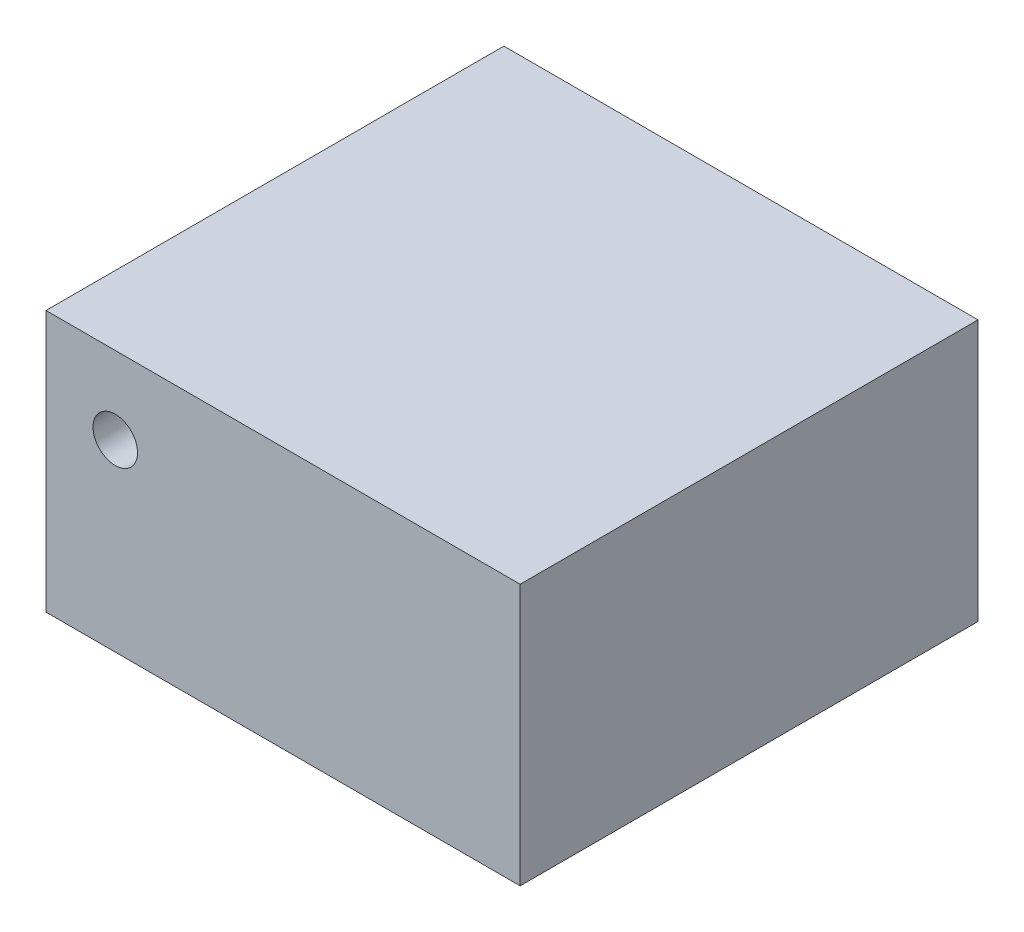
ISO-10303-21;
HEADER;
FILE_DESCRIPTION(('STEP AP214'),'2;1');
FILE_NAME('part.step','',(''),(''),'','','');
FILE_SCHEMA(('AUTOMOTIVE_DESIGN { 1 0 10303 214 1 1 1 1 }'));
ENDSEC;
DATA;
#1=APPLICATION_CONTEXT('core data for automotive mechanical design processes');
#2=APPLICATION_PROTOCOL_DEFINITION('international standard','automotive_design',2000,#1);
#3=PRODUCT_CONTEXT('',#1,'mechanical');
#4=PRODUCT('Part','Part','',(#3));
#5=PRODUCT_RELATED_PRODUCT_CATEGORY('part','',(#4));
#6=PRODUCT_DEFINITION_FORMATION('','',#4);
#7=PRODUCT_DEFINITION_CONTEXT('part definition',#1,'design');
#8=PRODUCT_DEFINITION('design','',#6,#7);
#9=PRODUCT_DEFINITION_SHAPE('','',#8);
#10=(LENGTH_UNIT() NAMED_UNIT(*) SI_UNIT(.MILLI.,.METRE.));
#11=(NAMED_UNIT(*) PLANE_ANGLE_UNIT() SI_UNIT($,.RADIAN.));
#12=(NAMED_UNIT(*) SI_UNIT($,.STERADIAN.) SOLID_ANGLE_UNIT());
#13=UNCERTAINTY_MEASURE_WITH_UNIT(LENGTH_MEASURE(1.E-05),#10,'distance_accuracy_value','');
#14=(GEOMETRIC_REPRESENTATION_CONTEXT(3) GLOBAL_UNCERTAINTY_ASSIGNED_CONTEXT((#13)) GLOBAL_UNIT_ASSIGNED_CONTEXT((#10,
#11,#12)) REPRESENTATION_CONTEXT('',''));
#15=CARTESIAN_POINT('',(0.,0.,0.));
#16=DIRECTION('',(0.,0.,1.));
#17=DIRECTION('',(1.,0.,0.));
#18=AXIS2_PLACEMENT_3D('',#15,#16,#17);
#19=CARTESIAN_POINT('',(0.,0.,0.));
#20=DIRECTION('',(0.,0.,1.));
#21=DIRECTION('',(1.,0.,0.));
#22=AXIS2_PLACEMENT_3D('',#19,#20,#21);
#23=PLANE('',#22);
#24=CARTESIAN_POINT('',(-11.0109,3.4925,0.));
#25=DIRECTION('',(0.,0.,-1.));
#26=DIRECTION('',(-1.,0.,0.));
#27=AXIS2_PLACEMENT_3D('',#24,#25,#26);
#28=CIRCLE('',#27,1.4605);
#29=CARTESIAN_POINT('',(-12.4714,3.4925,0.));
#30=VERTEX_POINT('',#29);
#31=EDGE_CURVE('E199',#30,#30,#28,.T.);
#32=ORIENTED_EDGE('',*,*,#31,.F.);
#33=EDGE_LOOP('',(#32));
#34=FACE_BOUND('',#33,.T.);
#35=DIRECTION('',(0.,-1.,0.));
#36=VECTOR('',#35,1.);
#37=CARTESIAN_POINT('',(6.79450000000001,-6.5913,0.));
#38=LINE('',#37,#36);
#39=CARTESIAN_POINT('',(6.79450000000001,-6.5913,0.));
#40=VERTEX_POINT('',#39);
#41=CARTESIAN_POINT('',(6.79450000000001,-8.5725,0.));
#42=VERTEX_POINT('',#41);
#43=EDGE_CURVE('E266',#40,#42,#38,.T.);
#44=ORIENTED_EDGE('',*,*,#43,.F.);
#45=DIRECTION('',(-1.,0.,0.));
#46=VECTOR('',#45,1.);
#47=CARTESIAN_POINT('',(-2.14629999999999,-6.5913,0.));
#48=LINE('',#47,#46);
#49=CARTESIAN_POINT('',(-2.14629999999999,-6.5913,0.));
#50=VERTEX_POINT('',#49);
#51=EDGE_CURVE('E250',#40,#50,#48,.T.);
#52=ORIENTED_EDGE('',*,*,#51,.T.);
#53=DIRECTION('',(0.,-1.,0.));
#54=VECTOR('',#53,1.);
#55=CARTESIAN_POINT('',(-2.14629999999999,-6.5913,0.));
#56=LINE('',#55,#54);
#57=CARTESIAN_POINT('',(-2.14629999999999,-8.5725,0.));
#58=VERTEX_POINT('',#57);
#59=EDGE_CURVE('E286',#50,#58,#56,.T.);
#60=ORIENTED_EDGE('',*,*,#59,.T.);
#61=DIRECTION('',(1.,0.,0.));
#62=VECTOR('',#61,1.);
#63=CARTESIAN_POINT('',(-15.5575,-8.5725,0.));
#64=LINE('',#63,#62);
#65=CARTESIAN_POINT('',(-15.5575,-8.5725,0.));
#66=VERTEX_POINT('',#65);
#67=EDGE_CURVE('E291',#66,#58,#64,.T.);
#68=ORIENTED_EDGE('',*,*,#67,.F.);
#69=DIRECTION('',(0.,-1.,0.));
#70=VECTOR('',#69,1.);
#71=CARTESIAN_POINT('',(-15.5575,8.5725,0.));
#72=LINE('',#71,#70);
#73=CARTESIAN_POINT('',(-15.5575,8.5725,0.));
#74=VERTEX_POINT('',#73);
#75=EDGE_CURVE('E301',#74,#66,#72,.T.);
#76=ORIENTED_EDGE('',*,*,#75,.F.);
#77=DIRECTION('',(-1.,0.,0.));
#78=VECTOR('',#77,1.);
#79=CARTESIAN_POINT('',(-15.5575,8.5725,0.));
#80=LINE('',#79,#78);
#81=CARTESIAN_POINT('',(15.5575,8.5725,0.));
#82=VERTEX_POINT('',#81);
#83=EDGE_CURVE('E299',#82,#74,#80,.T.);
#84=ORIENTED_EDGE('',*,*,#83,.F.);
#85=DIRECTION('',(0.,1.,0.));
#86=VECTOR('',#85,1.);
#87=CARTESIAN_POINT('',(15.5575,8.5725,0.));
#88=LINE('',#87,#86);
#89=CARTESIAN_POINT('',(15.5575,-8.5725,0.));
#90=VERTEX_POINT('',#89);
#91=EDGE_CURVE('E279',#90,#82,#88,.T.);
#92=ORIENTED_EDGE('',*,*,#91,.F.);
#93=EDGE_CURVE('E78',#42,#90,#64,.T.);
#94=ORIENTED_EDGE('',*,*,#93,.F.);
#95=EDGE_LOOP('',(#44,#52,#60,#68,#76,#84,#92,#94));
#96=FACE_BOUND('',#95,.T.);
#97=ADVANCED_FACE('F33',(#34,#96),#23,.F.);
#98=CARTESIAN_POINT('',(15.5575,8.5725,30.0482));
#99=DIRECTION('',(-1.,0.,0.));
#100=DIRECTION('',(0.,0.,1.));
#101=AXIS2_PLACEMENT_3D('',#98,#99,#100);
#102=PLANE('',#101);
#103=ORIENTED_EDGE('',*,*,#91,.T.);
#104=DIRECTION('',(0.,0.,-1.));
#105=VECTOR('',#104,1.);
#106=CARTESIAN_POINT('',(15.5575,8.5725,30.0482));
#107=LINE('',#106,#105);
#108=CARTESIAN_POINT('',(15.5575,8.5725,30.0482));
#109=VERTEX_POINT('',#108);
#110=EDGE_CURVE('E11',#109,#82,#107,.T.);
#111=ORIENTED_EDGE('',*,*,#110,.F.);
#112=DIRECTION('',(0.,1.,0.));
#113=VECTOR('',#112,1.);
#114=CARTESIAN_POINT('',(15.5575,8.5725,30.0482));
#115=LINE('',#114,#113);
#116=CARTESIAN_POINT('',(15.5575,-8.5725,30.0482));
#117=VERTEX_POINT('',#116);
#118=EDGE_CURVE('E289',#117,#109,#115,.T.);
#119=ORIENTED_EDGE('',*,*,#118,.F.);
#120=DIRECTION('',(0.,0.,-1.));
#121=VECTOR('',#120,1.);
#122=CARTESIAN_POINT('',(15.5575,-8.5725,30.0482));
#123=LINE('',#122,#121);
#124=EDGE_CURVE('E296',#117,#90,#123,.T.);
#125=ORIENTED_EDGE('',*,*,#124,.T.);
#126=EDGE_LOOP('',(#103,#111,#119,#125));
#127=FACE_BOUND('',#126,.T.);
#128=ADVANCED_FACE('F35',(#127),#102,.F.);
#129=CARTESIAN_POINT('',(-15.5575,8.5725,30.0482));
#130=DIRECTION('',(0.,-1.,0.));
#131=DIRECTION('',(0.,0.,-1.));
#132=AXIS2_PLACEMENT_3D('',#129,#130,#131);
#133=PLANE('',#132);
#134=ORIENTED_EDGE('',*,*,#83,.T.);
#135=DIRECTION('',(0.,0.,-1.));
#136=VECTOR('',#135,1.);
#137=CARTESIAN_POINT('',(-15.5575,8.5725,30.0482));
#138=LINE('',#137,#136);
#139=CARTESIAN_POINT('',(-15.5575,8.5725,30.0482));
#140=VERTEX_POINT('',#139);
#141=EDGE_CURVE('E41',#140,#74,#138,.T.);
#142=ORIENTED_EDGE('',*,*,#141,.F.);
#143=DIRECTION('',(-1.,0.,0.));
#144=VECTOR('',#143,1.);
#145=CARTESIAN_POINT('',(-15.5575,8.5725,30.0482));
#146=LINE('',#145,#144);
#147=EDGE_CURVE('E85',#109,#140,#146,.T.);
#148=ORIENTED_EDGE('',*,*,#147,.F.);
#149=ORIENTED_EDGE('',*,*,#110,.T.);
#150=EDGE_LOOP('',(#134,#142,#148,#149));
#151=FACE_BOUND('',#150,.T.);
#152=ADVANCED_FACE('F343',(#151),#133,.F.);
#153=CARTESIAN_POINT('',(-15.5575,8.5725,30.0482));
#154=DIRECTION('',(1.,0.,0.));
#155=DIRECTION('',(0.,1.,0.));
#156=AXIS2_PLACEMENT_3D('',#153,#154,#155);
#157=PLANE('',#156);
#158=ORIENTED_EDGE('',*,*,#75,.T.);
#159=DIRECTION('',(0.,0.,-1.));
#160=VECTOR('',#159,1.);
#161=CARTESIAN_POINT('',(-15.5575,-8.5725,30.0482));
#162=LINE('',#161,#160);
#163=CARTESIAN_POINT('',(-15.5575,-8.5725,30.0482));
#164=VERTEX_POINT('',#163);
#165=EDGE_CURVE('E306',#164,#66,#162,.T.);
#166=ORIENTED_EDGE('',*,*,#165,.F.);
#167=DIRECTION('',(0.,-1.,0.));
#168=VECTOR('',#167,1.);
#169=CARTESIAN_POINT('',(-15.5575,8.5725,30.0482));
#170=LINE('',#169,#168);
#171=EDGE_CURVE('E293',#140,#164,#170,.T.);
#172=ORIENTED_EDGE('',*,*,#171,.F.);
#173=ORIENTED_EDGE('',*,*,#141,.T.);
#174=EDGE_LOOP('',(#158,#166,#172,#173));
#175=FACE_BOUND('',#174,.T.);
#176=ADVANCED_FACE('F312',(#175),#157,.F.);
#177=CARTESIAN_POINT('',(-15.5575,-8.5725,30.0482));
#178=DIRECTION('',(0.,1.,0.));
#179=DIRECTION('',(0.,0.,1.));
#180=AXIS2_PLACEMENT_3D('',#177,#178,#179);
#181=PLANE('',#180);
#182=ORIENTED_EDGE('',*,*,#67,.T.);
#183=DIRECTION('',(0.,0.,-1.));
#184=VECTOR('',#183,1.);
#185=CARTESIAN_POINT('',(-2.14629999999999,-8.5725,-6.19759999999999));
#186=LINE('',#185,#184);
#187=CARTESIAN_POINT('',(-2.14629999999999,-8.5725,-6.19759999999999));
#188=VERTEX_POINT('',#187);
#189=EDGE_CURVE('E48',#58,#188,#186,.T.);
#190=ORIENTED_EDGE('',*,*,#189,.T.);
#191=CARTESIAN_POINT('',(-0.876299999999994,-8.5725,-6.1976));
#192=DIRECTION('',(0.,-1.,0.));
#193=DIRECTION('',(0.,0.,1.));
#194=AXIS2_PLACEMENT_3D('',#191,#192,#193);
#195=CIRCLE('',#194,1.27);
#196=CARTESIAN_POINT('',(-0.876299999999984,-8.5725,-7.4676));
#197=VERTEX_POINT('',#196);
#198=EDGE_CURVE('E269',#188,#197,#195,.T.);
#199=ORIENTED_EDGE('',*,*,#198,.T.);
#200=DIRECTION('',(1.,0.,0.));
#201=VECTOR('',#200,1.);
#202=CARTESIAN_POINT('',(-0.876299999999984,-8.5725,-7.4676));
#203=LINE('',#202,#201);
#204=CARTESIAN_POINT('',(5.5245,-8.5725,-7.4676));
#205=VERTEX_POINT('',#204);
#206=EDGE_CURVE('E272',#197,#205,#203,.T.);
#207=ORIENTED_EDGE('',*,*,#206,.T.);
#208=CARTESIAN_POINT('',(5.52450000000001,-8.5725,-6.1976));
#209=DIRECTION('',(0.,-1.,0.));
#210=DIRECTION('',(0.,0.,-1.));
#211=AXIS2_PLACEMENT_3D('',#208,#209,#210);
#212=CIRCLE('',#211,1.27);
#213=CARTESIAN_POINT('',(6.79450000000001,-8.5725,-6.19759999999999));
#214=VERTEX_POINT('',#213);
#215=EDGE_CURVE('E251',#205,#214,#212,.T.);
#216=ORIENTED_EDGE('',*,*,#215,.T.);
#217=DIRECTION('',(0.,0.,1.));
#218=VECTOR('',#217,1.);
#219=CARTESIAN_POINT('',(6.79450000000001,-8.5725,-6.19759999999999));
#220=LINE('',#219,#218);
#221=EDGE_CURVE('E235',#214,#42,#220,.T.);
#222=ORIENTED_EDGE('',*,*,#221,.T.);
#223=ORIENTED_EDGE('',*,*,#93,.T.);
#224=ORIENTED_EDGE('',*,*,#124,.F.);
#225=DIRECTION('',(1.,0.,0.));
#226=VECTOR('',#225,1.);
#227=CARTESIAN_POINT('',(-15.5575,-8.5725,30.0482));
#228=LINE('',#227,#226);
#229=EDGE_CURVE('E57',#164,#117,#228,.T.);
#230=ORIENTED_EDGE('',*,*,#229,.F.);
#231=ORIENTED_EDGE('',*,*,#165,.T.);
#232=EDGE_LOOP('',(#182,#190,#199,#207,#216,#222,#223,#224,#230,#231));
#233=FACE_BOUND('',#232,.T.);
#234=DIRECTION('',(0.,0.,1.));
#235=VECTOR('',#234,1.);
#236=CARTESIAN_POINT('',(5.1562,-8.5725,-4.16559999999999));
#237=LINE('',#236,#235);
#238=CARTESIAN_POINT('',(5.1562,-8.5725,-4.16559999999999));
#239=VERTEX_POINT('',#238);
#240=CARTESIAN_POINT('',(5.1562,-8.5725,-3.53060000000001));
#241=VERTEX_POINT('',#240);
#242=EDGE_CURVE('E216',#239,#241,#237,.T.);
#243=ORIENTED_EDGE('',*,*,#242,.F.);
#244=CARTESIAN_POINT('',(3.8862,-8.5725,-4.1656));
#245=DIRECTION('',(0.,-1.,0.));
#246=DIRECTION('',(0.,0.,-1.));
#247=AXIS2_PLACEMENT_3D('',#244,#245,#246);
#248=CIRCLE('',#247,1.27);
#249=CARTESIAN_POINT('',(3.8862,-8.5725,-5.4356));
#250=VERTEX_POINT('',#249);
#251=EDGE_CURVE('E174',#250,#239,#248,.T.);
#252=ORIENTED_EDGE('',*,*,#251,.F.);
#253=DIRECTION('',(1.,0.,0.));
#254=VECTOR('',#253,1.);
#255=CARTESIAN_POINT('',(0.685800000000014,-8.5725,-5.4356));
#256=LINE('',#255,#254);
#257=CARTESIAN_POINT('',(0.685800000000014,-8.5725,-5.4356));
#258=VERTEX_POINT('',#257);
#259=EDGE_CURVE('E193',#258,#250,#256,.T.);
#260=ORIENTED_EDGE('',*,*,#259,.F.);
#261=CARTESIAN_POINT('',(0.685800000000005,-8.5725,-4.1656));
#262=DIRECTION('',(0.,-1.,0.));
#263=DIRECTION('',(0.,0.,1.));
#264=AXIS2_PLACEMENT_3D('',#261,#262,#263);
#265=CIRCLE('',#264,1.27);
#266=CARTESIAN_POINT('',(-0.584199999999995,-8.5725,-4.16559999999999));
#267=VERTEX_POINT('',#266);
#268=EDGE_CURVE('E196',#267,#258,#265,.T.);
#269=ORIENTED_EDGE('',*,*,#268,.F.);
#270=DIRECTION('',(0.,0.,-1.));
#271=VECTOR('',#270,1.);
#272=CARTESIAN_POINT('',(-0.584199999999995,-8.5725,-4.16559999999999));
#273=LINE('',#272,#271);
#274=CARTESIAN_POINT('',(-0.584199999999995,-8.5725,-3.53060000000001));
#275=VERTEX_POINT('',#274);
#276=EDGE_CURVE('E228',#275,#267,#273,.T.);
#277=ORIENTED_EDGE('',*,*,#276,.F.);
#278=CARTESIAN_POINT('',(0.685800000000005,-8.5725,-3.5306));
#279=DIRECTION('',(0.,-1.,0.));
#280=DIRECTION('',(0.,0.,1.));
#281=AXIS2_PLACEMENT_3D('',#278,#279,#280);
#282=CIRCLE('',#281,1.27);
#283=CARTESIAN_POINT('',(0.685800000000005,-8.5725,-2.2606));
#284=VERTEX_POINT('',#283);
#285=EDGE_CURVE('E225',#284,#275,#282,.T.);
#286=ORIENTED_EDGE('',*,*,#285,.F.);
#287=DIRECTION('',(-1.,0.,0.));
#288=VECTOR('',#287,1.);
#289=CARTESIAN_POINT('',(0.685800000000014,-8.5725,-2.2606));
#290=LINE('',#289,#288);
#291=CARTESIAN_POINT('',(3.8862,-8.5725,-2.2606));
#292=VERTEX_POINT('',#291);
#293=EDGE_CURVE('E222',#292,#284,#290,.T.);
#294=ORIENTED_EDGE('',*,*,#293,.F.);
#295=CARTESIAN_POINT('',(3.8862,-8.5725,-3.5306));
#296=DIRECTION('',(0.,-1.,0.));
#297=DIRECTION('',(0.,0.,1.));
#298=AXIS2_PLACEMENT_3D('',#295,#296,#297);
#299=CIRCLE('',#298,1.27);
#300=EDGE_CURVE('E219',#241,#292,#299,.T.);
#301=ORIENTED_EDGE('',*,*,#300,.F.);
#302=EDGE_LOOP('',(#243,#252,#260,#269,#277,#286,#294,#301));
#303=FACE_BOUND('',#302,.T.);
#304=ADVANCED_FACE('F318',(#233,#303),#181,.F.);
#305=CARTESIAN_POINT('',(0.,0.,30.0482));
#306=DIRECTION('',(0.,0.,1.));
#307=DIRECTION('',(1.,0.,0.));
#308=AXIS2_PLACEMENT_3D('',#305,#306,#307);
#309=PLANE('',#308);
#310=CARTESIAN_POINT('',(-11.0109,3.4925,30.0482));
#311=DIRECTION('',(0.,0.,-1.));
#312=DIRECTION('',(-1.,0.,0.));
#313=AXIS2_PLACEMENT_3D('',#310,#311,#312);
#314=CIRCLE('',#313,1.4605);
#315=CARTESIAN_POINT('',(-12.4714,3.4925,30.0482));
#316=VERTEX_POINT('',#315);
#317=EDGE_CURVE('E217',#316,#316,#314,.T.);
#318=ORIENTED_EDGE('',*,*,#317,.T.);
#319=EDGE_LOOP('',(#318));
#320=FACE_BOUND('',#319,.T.);
#321=ORIENTED_EDGE('',*,*,#118,.T.);
#322=ORIENTED_EDGE('',*,*,#147,.T.);
#323=ORIENTED_EDGE('',*,*,#171,.T.);
#324=ORIENTED_EDGE('',*,*,#229,.T.);
#325=EDGE_LOOP('',(#321,#322,#323,#324));
#326=FACE_BOUND('',#325,.T.);
#327=ADVANCED_FACE('F323',(#320,#326),#309,.T.);
#328=CARTESIAN_POINT('',(6.79450000000001,-6.5913,-6.19759999999999));
#329=DIRECTION('',(1.,0.,0.));
#330=DIRECTION('',(0.,0.,-1.));
#331=AXIS2_PLACEMENT_3D('',#328,#329,#330);
#332=PLANE('',#331);
#333=ORIENTED_EDGE('',*,*,#221,.F.);
#334=DIRECTION('',(0.,-1.,0.));
#335=VECTOR('',#334,1.);
#336=CARTESIAN_POINT('',(6.79450000000001,-6.5913,-6.19759999999999));
#337=LINE('',#336,#335);
#338=CARTESIAN_POINT('',(6.79450000000001,-6.5913,-6.19759999999999));
#339=VERTEX_POINT('',#338);
#340=EDGE_CURVE('E277',#339,#214,#337,.T.);
#341=ORIENTED_EDGE('',*,*,#340,.F.);
#342=DIRECTION('',(0.,0.,1.));
#343=VECTOR('',#342,1.);
#344=CARTESIAN_POINT('',(6.79450000000001,-6.5913,-6.19759999999999));
#345=LINE('',#344,#343);
#346=EDGE_CURVE('E247',#339,#40,#345,.T.);
#347=ORIENTED_EDGE('',*,*,#346,.T.);
#348=ORIENTED_EDGE('',*,*,#43,.T.);
#349=EDGE_LOOP('',(#333,#341,#347,#348));
#350=FACE_BOUND('',#349,.T.);
#351=ADVANCED_FACE('F325',(#350),#332,.T.);
#352=CARTESIAN_POINT('',(5.52450000000001,-6.5913,-6.1976));
#353=DIRECTION('',(0.,-1.,0.));
#354=DIRECTION('',(0.,0.,-1.));
#355=AXIS2_PLACEMENT_3D('',#352,#353,#354);
#356=CYLINDRICAL_SURFACE('',#355,1.27);
#357=ORIENTED_EDGE('',*,*,#215,.F.);
#358=DIRECTION('',(0.,-1.,0.));
#359=VECTOR('',#358,1.);
#360=CARTESIAN_POINT('',(5.5245,-6.5913,-7.4676));
#361=LINE('',#360,#359);
#362=CARTESIAN_POINT('',(5.5245,-6.5913,-7.4676));
#363=VERTEX_POINT('',#362);
#364=EDGE_CURVE('E280',#363,#205,#361,.T.);
#365=ORIENTED_EDGE('',*,*,#364,.F.);
#366=CARTESIAN_POINT('',(5.52450000000001,-6.5913,-6.1976));
#367=DIRECTION('',(0.,-1.,0.));
#368=DIRECTION('',(0.,0.,-1.));
#369=AXIS2_PLACEMENT_3D('',#366,#367,#368);
#370=CIRCLE('',#369,1.27);
#371=EDGE_CURVE('E263',#363,#339,#370,.T.);
#372=ORIENTED_EDGE('',*,*,#371,.T.);
#373=ORIENTED_EDGE('',*,*,#340,.T.);
#374=EDGE_LOOP('',(#357,#365,#372,#373));
#375=FACE_BOUND('',#374,.T.);
#376=ADVANCED_FACE('F332',(#375),#356,.T.);
#377=CARTESIAN_POINT('',(-0.876299999999984,-6.5913,-7.4676));
#378=DIRECTION('',(0.,0.,-1.));
#379=DIRECTION('',(-1.,0.,0.));
#380=AXIS2_PLACEMENT_3D('',#377,#378,#379);
#381=PLANE('',#380);
#382=ORIENTED_EDGE('',*,*,#206,.F.);
#383=DIRECTION('',(0.,-1.,0.));
#384=VECTOR('',#383,1.);
#385=CARTESIAN_POINT('',(-0.876299999999984,-6.5913,-7.4676));
#386=LINE('',#385,#384);
#387=CARTESIAN_POINT('',(-0.876299999999984,-6.5913,-7.4676));
#388=VERTEX_POINT('',#387);
#389=EDGE_CURVE('E282',#388,#197,#386,.T.);
#390=ORIENTED_EDGE('',*,*,#389,.F.);
#391=DIRECTION('',(1.,0.,0.));
#392=VECTOR('',#391,1.);
#393=CARTESIAN_POINT('',(-0.876299999999984,-6.5913,-7.4676));
#394=LINE('',#393,#392);
#395=EDGE_CURVE('E260',#388,#363,#394,.T.);
#396=ORIENTED_EDGE('',*,*,#395,.T.);
#397=ORIENTED_EDGE('',*,*,#364,.T.);
#398=EDGE_LOOP('',(#382,#390,#396,#397));
#399=FACE_BOUND('',#398,.T.);
#400=ADVANCED_FACE('F364',(#399),#381,.T.);
#401=CARTESIAN_POINT('',(-0.876299999999994,-6.5913,-6.1976));
#402=DIRECTION('',(0.,-1.,0.));
#403=DIRECTION('',(0.,0.,-1.));
#404=AXIS2_PLACEMENT_3D('',#401,#402,#403);
#405=CYLINDRICAL_SURFACE('',#404,1.27);
#406=ORIENTED_EDGE('',*,*,#198,.F.);
#407=DIRECTION('',(0.,-1.,0.));
#408=VECTOR('',#407,1.);
#409=CARTESIAN_POINT('',(-2.14629999999999,-6.5913,-6.19759999999999));
#410=LINE('',#409,#408);
#411=CARTESIAN_POINT('',(-2.14629999999999,-6.5913,-6.19759999999999));
#412=VERTEX_POINT('',#411);
#413=EDGE_CURVE('E284',#412,#188,#410,.T.);
#414=ORIENTED_EDGE('',*,*,#413,.F.);
#415=CARTESIAN_POINT('',(-0.876299999999994,-6.5913,-6.1976));
#416=DIRECTION('',(0.,-1.,0.));
#417=DIRECTION('',(0.,0.,1.));
#418=AXIS2_PLACEMENT_3D('',#415,#416,#417);
#419=CIRCLE('',#418,1.27);
#420=EDGE_CURVE('E257',#412,#388,#419,.T.);
#421=ORIENTED_EDGE('',*,*,#420,.T.);
#422=ORIENTED_EDGE('',*,*,#389,.T.);
#423=EDGE_LOOP('',(#406,#414,#421,#422));
#424=FACE_BOUND('',#423,.T.);
#425=ADVANCED_FACE('F362',(#424),#405,.T.);
#426=CARTESIAN_POINT('',(-2.14629999999999,-6.5913,-6.19759999999999));
#427=DIRECTION('',(-1.,0.,0.));
#428=DIRECTION('',(0.,0.,1.));
#429=AXIS2_PLACEMENT_3D('',#426,#427,#428);
#430=PLANE('',#429);
#431=ORIENTED_EDGE('',*,*,#189,.F.);
#432=ORIENTED_EDGE('',*,*,#59,.F.);
#433=DIRECTION('',(0.,0.,-1.));
#434=VECTOR('',#433,1.);
#435=CARTESIAN_POINT('',(-2.14629999999999,-6.5913,-6.19759999999999));
#436=LINE('',#435,#434);
#437=EDGE_CURVE('E254',#50,#412,#436,.T.);
#438=ORIENTED_EDGE('',*,*,#437,.T.);
#439=ORIENTED_EDGE('',*,*,#413,.T.);
#440=EDGE_LOOP('',(#431,#432,#438,#439));
#441=FACE_BOUND('',#440,.T.);
#442=ADVANCED_FACE('F359',(#441),#430,.T.);
#443=CARTESIAN_POINT('',(-0.876299999999994,-6.5913,-6.1976));
#444=DIRECTION('',(0.,1.,0.));
#445=DIRECTION('',(0.,0.,1.));
#446=AXIS2_PLACEMENT_3D('',#443,#444,#445);
#447=PLANE('',#446);
#448=CARTESIAN_POINT('',(3.8862,-6.5913,-4.1656));
#449=DIRECTION('',(0.,-1.,0.));
#450=DIRECTION('',(0.,0.,-1.));
#451=AXIS2_PLACEMENT_3D('',#448,#449,#450);
#452=CIRCLE('',#451,1.27);
#453=CARTESIAN_POINT('',(3.8862,-6.5913,-5.4356));
#454=VERTEX_POINT('',#453);
#455=CARTESIAN_POINT('',(5.1562,-6.5913,-4.16559999999999));
#456=VERTEX_POINT('',#455);
#457=EDGE_CURVE('E171',#454,#456,#452,.T.);
#458=ORIENTED_EDGE('',*,*,#457,.T.);
#459=DIRECTION('',(0.,0.,1.));
#460=VECTOR('',#459,1.);
#461=CARTESIAN_POINT('',(5.1562,-6.5913,-4.16559999999999));
#462=LINE('',#461,#460);
#463=CARTESIAN_POINT('',(5.1562,-6.5913,-3.53060000000001));
#464=VERTEX_POINT('',#463);
#465=EDGE_CURVE('E183',#456,#464,#462,.T.);
#466=ORIENTED_EDGE('',*,*,#465,.T.);
#467=CARTESIAN_POINT('',(3.8862,-6.5913,-3.5306));
#468=DIRECTION('',(0.,-1.,0.));
#469=DIRECTION('',(0.,0.,1.));
#470=AXIS2_PLACEMENT_3D('',#467,#468,#469);
#471=CIRCLE('',#470,1.27);
#472=CARTESIAN_POINT('',(3.8862,-6.5913,-2.2606));
#473=VERTEX_POINT('',#472);
#474=EDGE_CURVE('E187',#464,#473,#471,.T.);
#475=ORIENTED_EDGE('',*,*,#474,.T.);
#476=DIRECTION('',(-1.,0.,0.));
#477=VECTOR('',#476,1.);
#478=CARTESIAN_POINT('',(0.685800000000014,-6.5913,-2.2606));
#479=LINE('',#478,#477);
#480=CARTESIAN_POINT('',(0.685800000000005,-6.5913,-2.2606));
#481=VERTEX_POINT('',#480);
#482=EDGE_CURVE('E203',#473,#481,#479,.T.);
#483=ORIENTED_EDGE('',*,*,#482,.T.);
#484=CARTESIAN_POINT('',(0.685800000000005,-6.5913,-3.5306));
#485=DIRECTION('',(0.,-1.,0.));
#486=DIRECTION('',(0.,0.,1.));
#487=AXIS2_PLACEMENT_3D('',#484,#485,#486);
#488=CIRCLE('',#487,1.27);
#489=CARTESIAN_POINT('',(-0.584199999999995,-6.5913,-3.53060000000001));
#490=VERTEX_POINT('',#489);
#491=EDGE_CURVE('E206',#481,#490,#488,.T.);
#492=ORIENTED_EDGE('',*,*,#491,.T.);
#493=DIRECTION('',(0.,0.,-1.));
#494=VECTOR('',#493,1.);
#495=CARTESIAN_POINT('',(-0.584199999999995,-6.5913,-4.16559999999999));
#496=LINE('',#495,#494);
#497=CARTESIAN_POINT('',(-0.584199999999995,-6.5913,-4.16559999999999));
#498=VERTEX_POINT('',#497);
#499=EDGE_CURVE('E209',#490,#498,#496,.T.);
#500=ORIENTED_EDGE('',*,*,#499,.T.);
#501=CARTESIAN_POINT('',(0.685800000000005,-6.5913,-4.1656));
#502=DIRECTION('',(0.,-1.,0.));
#503=DIRECTION('',(0.,0.,1.));
#504=AXIS2_PLACEMENT_3D('',#501,#502,#503);
#505=CIRCLE('',#504,1.27);
#506=CARTESIAN_POINT('',(0.685800000000014,-6.5913,-5.4356));
#507=VERTEX_POINT('',#506);
#508=EDGE_CURVE('E212',#498,#507,#505,.T.);
#509=ORIENTED_EDGE('',*,*,#508,.T.);
#510=DIRECTION('',(1.,0.,0.));
#511=VECTOR('',#510,1.);
#512=CARTESIAN_POINT('',(0.685800000000014,-6.5913,-5.4356));
#513=LINE('',#512,#511);
#514=EDGE_CURVE('E179',#507,#454,#513,.T.);
#515=ORIENTED_EDGE('',*,*,#514,.T.);
#516=EDGE_LOOP('',(#458,#466,#475,#483,#492,#500,#509,#515));
#517=FACE_BOUND('',#516,.T.);
#518=ORIENTED_EDGE('',*,*,#346,.F.);
#519=ORIENTED_EDGE('',*,*,#371,.F.);
#520=ORIENTED_EDGE('',*,*,#395,.F.);
#521=ORIENTED_EDGE('',*,*,#420,.F.);
#522=ORIENTED_EDGE('',*,*,#437,.F.);
#523=ORIENTED_EDGE('',*,*,#51,.F.);
#524=EDGE_LOOP('',(#518,#519,#520,#521,#522,#523));
#525=FACE_BOUND('',#524,.T.);
#526=ADVANCED_FACE('F189',(#517,#525),#447,.T.);
#527=CARTESIAN_POINT('',(3.8862,-6.5913,-4.1656));
#528=DIRECTION('',(0.,-1.,0.));
#529=DIRECTION('',(0.,0.,-1.));
#530=AXIS2_PLACEMENT_3D('',#527,#528,#529);
#531=CYLINDRICAL_SURFACE('',#530,1.27);
#532=ORIENTED_EDGE('',*,*,#251,.T.);
#533=DIRECTION('',(0.,-1.,0.));
#534=VECTOR('',#533,1.);
#535=CARTESIAN_POINT('',(5.1562,-6.5913,-4.16559999999999));
#536=LINE('',#535,#534);
#537=EDGE_CURVE('E167',#456,#239,#536,.T.);
#538=ORIENTED_EDGE('',*,*,#537,.F.);
#539=ORIENTED_EDGE('',*,*,#457,.F.);
#540=DIRECTION('',(0.,-1.,0.));
#541=VECTOR('',#540,1.);
#542=CARTESIAN_POINT('',(3.8862,-6.5913,-5.4356));
#543=LINE('',#542,#541);
#544=EDGE_CURVE('E233',#454,#250,#543,.T.);
#545=ORIENTED_EDGE('',*,*,#544,.T.);
#546=EDGE_LOOP('',(#532,#538,#539,#545));
#547=FACE_BOUND('',#546,.T.);
#548=ADVANCED_FACE('F169',(#547),#531,.F.);
#549=CARTESIAN_POINT('',(0.685800000000014,-6.5913,-5.4356));
#550=DIRECTION('',(0.,0.,-1.));
#551=DIRECTION('',(-1.,0.,0.));
#552=AXIS2_PLACEMENT_3D('',#549,#550,#551);
#553=PLANE('',#552);
#554=ORIENTED_EDGE('',*,*,#259,.T.);
#555=ORIENTED_EDGE('',*,*,#544,.F.);
#556=ORIENTED_EDGE('',*,*,#514,.F.);
#557=DIRECTION('',(0.,-1.,0.));
#558=VECTOR('',#557,1.);
#559=CARTESIAN_POINT('',(0.685800000000014,-6.5913,-5.4356));
#560=LINE('',#559,#558);
#561=EDGE_CURVE('E236',#507,#258,#560,.T.);
#562=ORIENTED_EDGE('',*,*,#561,.T.);
#563=EDGE_LOOP('',(#554,#555,#556,#562));
#564=FACE_BOUND('',#563,.T.);
#565=ADVANCED_FACE('F382',(#564),#553,.F.);
#566=CARTESIAN_POINT('',(0.685800000000005,-6.5913,-4.1656));
#567=DIRECTION('',(0.,-1.,0.));
#568=DIRECTION('',(0.,0.,-1.));
#569=AXIS2_PLACEMENT_3D('',#566,#567,#568);
#570=CYLINDRICAL_SURFACE('',#569,1.27);
#571=ORIENTED_EDGE('',*,*,#268,.T.);
#572=ORIENTED_EDGE('',*,*,#561,.F.);
#573=ORIENTED_EDGE('',*,*,#508,.F.);
#574=DIRECTION('',(0.,-1.,0.));
#575=VECTOR('',#574,1.);
#576=CARTESIAN_POINT('',(-0.584199999999995,-6.5913,-4.16559999999999));
#577=LINE('',#576,#575);
#578=EDGE_CURVE('E238',#498,#267,#577,.T.);
#579=ORIENTED_EDGE('',*,*,#578,.T.);
#580=EDGE_LOOP('',(#571,#572,#573,#579));
#581=FACE_BOUND('',#580,.T.);
#582=ADVANCED_FACE('F403',(#581),#570,.F.);
#583=CARTESIAN_POINT('',(-0.584199999999995,-6.5913,-4.16559999999999));
#584=DIRECTION('',(-1.,0.,0.));
#585=DIRECTION('',(0.,0.,1.));
#586=AXIS2_PLACEMENT_3D('',#583,#584,#585);
#587=PLANE('',#586);
#588=ORIENTED_EDGE('',*,*,#276,.T.);
#589=ORIENTED_EDGE('',*,*,#578,.F.);
#590=ORIENTED_EDGE('',*,*,#499,.F.);
#591=DIRECTION('',(0.,-1.,0.));
#592=VECTOR('',#591,1.);
#593=CARTESIAN_POINT('',(-0.584199999999995,-6.5913,-3.53060000000001));
#594=LINE('',#593,#592);
#595=EDGE_CURVE('E240',#490,#275,#594,.T.);
#596=ORIENTED_EDGE('',*,*,#595,.T.);
#597=EDGE_LOOP('',(#588,#589,#590,#596));
#598=FACE_BOUND('',#597,.T.);
#599=ADVANCED_FACE('F399',(#598),#587,.F.);
#600=CARTESIAN_POINT('',(0.685800000000005,-6.5913,-3.5306));
#601=DIRECTION('',(0.,-1.,0.));
#602=DIRECTION('',(0.,0.,-1.));
#603=AXIS2_PLACEMENT_3D('',#600,#601,#602);
#604=CYLINDRICAL_SURFACE('',#603,1.27);
#605=ORIENTED_EDGE('',*,*,#285,.T.);
#606=ORIENTED_EDGE('',*,*,#595,.F.);
#607=ORIENTED_EDGE('',*,*,#491,.F.);
#608=DIRECTION('',(0.,-1.,0.));
#609=VECTOR('',#608,1.);
#610=CARTESIAN_POINT('',(0.685800000000005,-6.5913,-2.2606));
#611=LINE('',#610,#609);
#612=EDGE_CURVE('E242',#481,#284,#611,.T.);
#613=ORIENTED_EDGE('',*,*,#612,.T.);
#614=EDGE_LOOP('',(#605,#606,#607,#613));
#615=FACE_BOUND('',#614,.T.);
#616=ADVANCED_FACE('F395',(#615),#604,.F.);
#617=CARTESIAN_POINT('',(0.685800000000014,-6.5913,-2.2606));
#618=DIRECTION('',(0.,0.,1.));
#619=DIRECTION('',(1.,0.,0.));
#620=AXIS2_PLACEMENT_3D('',#617,#618,#619);
#621=PLANE('',#620);
#622=ORIENTED_EDGE('',*,*,#293,.T.);
#623=ORIENTED_EDGE('',*,*,#612,.F.);
#624=ORIENTED_EDGE('',*,*,#482,.F.);
#625=DIRECTION('',(0.,-1.,0.));
#626=VECTOR('',#625,1.);
#627=CARTESIAN_POINT('',(3.8862,-6.5913,-2.2606));
#628=LINE('',#627,#626);
#629=EDGE_CURVE('E244',#473,#292,#628,.T.);
#630=ORIENTED_EDGE('',*,*,#629,.T.);
#631=EDGE_LOOP('',(#622,#623,#624,#630));
#632=FACE_BOUND('',#631,.T.);
#633=ADVANCED_FACE('F391',(#632),#621,.F.);
#634=CARTESIAN_POINT('',(3.8862,-6.5913,-3.5306));
#635=DIRECTION('',(0.,-1.,0.));
#636=DIRECTION('',(0.,0.,-1.));
#637=AXIS2_PLACEMENT_3D('',#634,#635,#636);
#638=CYLINDRICAL_SURFACE('',#637,1.27);
#639=ORIENTED_EDGE('',*,*,#300,.T.);
#640=ORIENTED_EDGE('',*,*,#629,.F.);
#641=ORIENTED_EDGE('',*,*,#474,.F.);
#642=DIRECTION('',(0.,-1.,0.));
#643=VECTOR('',#642,1.);
#644=CARTESIAN_POINT('',(5.1562,-6.5913,-3.53060000000001));
#645=LINE('',#644,#643);
#646=EDGE_CURVE('E178',#464,#241,#645,.T.);
#647=ORIENTED_EDGE('',*,*,#646,.T.);
#648=EDGE_LOOP('',(#639,#640,#641,#647));
#649=FACE_BOUND('',#648,.T.);
#650=ADVANCED_FACE('F388',(#649),#638,.F.);
#651=CARTESIAN_POINT('',(5.1562,-6.5913,-4.16559999999999));
#652=DIRECTION('',(1.,0.,0.));
#653=DIRECTION('',(0.,0.,-1.));
#654=AXIS2_PLACEMENT_3D('',#651,#652,#653);
#655=PLANE('',#654);
#656=ORIENTED_EDGE('',*,*,#242,.T.);
#657=ORIENTED_EDGE('',*,*,#646,.F.);
#658=ORIENTED_EDGE('',*,*,#465,.F.);
#659=ORIENTED_EDGE('',*,*,#537,.T.);
#660=EDGE_LOOP('',(#656,#657,#658,#659));
#661=FACE_BOUND('',#660,.T.);
#662=ADVANCED_FACE('F184',(#661),#655,.F.);
#663=CARTESIAN_POINT('',(-11.0109,3.4925,30.0482));
#664=DIRECTION('',(0.,0.,-1.));
#665=DIRECTION('',(-1.,0.,0.));
#666=AXIS2_PLACEMENT_3D('',#663,#664,#665);
#667=CYLINDRICAL_SURFACE('',#666,1.4605);
#668=ORIENTED_EDGE('',*,*,#317,.F.);
#669=EDGE_LOOP('',(#668));
#670=FACE_BOUND('',#669,.T.);
#671=ORIENTED_EDGE('',*,*,#31,.T.);
#672=EDGE_LOOP('',(#671));
#673=FACE_BOUND('',#672,.T.);
#674=ADVANCED_FACE('F387',(#670,#673),#667,.F.);
#675=CLOSED_SHELL('',(#97,#128,#152,#176,#304,#327,#351,#376,#400,#425,#442,#526,#548,#565,#582,
#599,#616,#633,#650,#662,#674));
#676=MANIFOLD_SOLID_BREP('B2',#675);
#677=ADVANCED_BREP_SHAPE_REPRESENTATION('',(#18,#676),#14);
#678=SHAPE_DEFINITION_REPRESENTATION(#9,#677);
ENDSEC;
END-ISO-10303-21;
